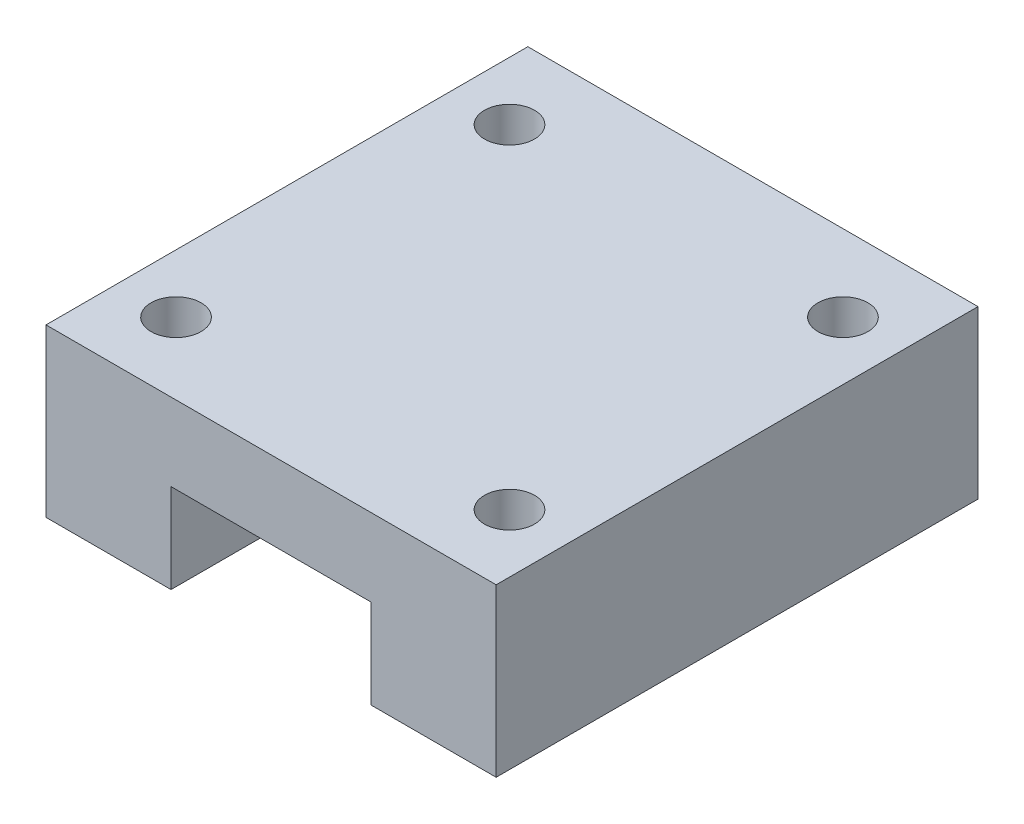
ISO-10303-21;
HEADER;
FILE_DESCRIPTION(('STEP AP214'),'2;1');
FILE_NAME('part.step','',(''),(''),'','','');
FILE_SCHEMA(('AUTOMOTIVE_DESIGN { 1 0 10303 214 1 1 1 1 }'));
ENDSEC;
DATA;
#1=APPLICATION_CONTEXT('core data for automotive mechanical design processes');
#2=APPLICATION_PROTOCOL_DEFINITION('international standard','automotive_design',2000,#1);
#3=PRODUCT_CONTEXT('',#1,'mechanical');
#4=PRODUCT('Part','Part','',(#3));
#5=PRODUCT_RELATED_PRODUCT_CATEGORY('part','',(#4));
#6=PRODUCT_DEFINITION_FORMATION('','',#4);
#7=PRODUCT_DEFINITION_CONTEXT('part definition',#1,'design');
#8=PRODUCT_DEFINITION('design','',#6,#7);
#9=PRODUCT_DEFINITION_SHAPE('','',#8);
#10=(LENGTH_UNIT() NAMED_UNIT(*) SI_UNIT(.MILLI.,.METRE.));
#11=(NAMED_UNIT(*) PLANE_ANGLE_UNIT() SI_UNIT($,.RADIAN.));
#12=(NAMED_UNIT(*) SI_UNIT($,.STERADIAN.) SOLID_ANGLE_UNIT());
#13=UNCERTAINTY_MEASURE_WITH_UNIT(LENGTH_MEASURE(1.E-05),#10,'distance_accuracy_value','');
#14=(GEOMETRIC_REPRESENTATION_CONTEXT(3) GLOBAL_UNCERTAINTY_ASSIGNED_CONTEXT((#13)) GLOBAL_UNIT_ASSIGNED_CONTEXT((#10,
#11,#12)) REPRESENTATION_CONTEXT('',''));
#15=CARTESIAN_POINT('',(0.,0.,0.));
#16=DIRECTION('',(0.,0.,1.));
#17=DIRECTION('',(1.,0.,0.));
#18=AXIS2_PLACEMENT_3D('',#15,#16,#17);
#19=CARTESIAN_POINT('',(0.,0.,0.));
#20=DIRECTION('',(0.,-1.,0.));
#21=DIRECTION('',(0.,0.,-1.));
#22=AXIS2_PLACEMENT_3D('',#19,#20,#21);
#23=PLANE('',#22);
#24=DIRECTION('',(0.,0.,1.));
#25=VECTOR('',#24,1.);
#26=CARTESIAN_POINT('',(7.5,0.,-28.9));
#27=LINE('',#26,#25);
#28=CARTESIAN_POINT('',(7.5,0.,-28.9));
#29=VERTEX_POINT('',#28);
#30=CARTESIAN_POINT('',(7.5,0.,0.));
#31=VERTEX_POINT('',#30);
#32=EDGE_CURVE('E161',#29,#31,#27,.T.);
#33=ORIENTED_EDGE('',*,*,#32,.T.);
#34=DIRECTION('',(1.,0.,0.));
#35=VECTOR('',#34,1.);
#36=CARTESIAN_POINT('',(0.,0.,0.));
#37=LINE('',#36,#35);
#38=CARTESIAN_POINT('',(0.,0.,0.));
#39=VERTEX_POINT('',#38);
#40=EDGE_CURVE('E193',#39,#31,#37,.T.);
#41=ORIENTED_EDGE('',*,*,#40,.F.);
#42=DIRECTION('',(0.,0.,1.));
#43=VECTOR('',#42,1.);
#44=CARTESIAN_POINT('',(0.,0.,0.));
#45=LINE('',#44,#43);
#46=CARTESIAN_POINT('',(0.,0.,-28.9));
#47=VERTEX_POINT('',#46);
#48=EDGE_CURVE('E181',#47,#39,#45,.T.);
#49=ORIENTED_EDGE('',*,*,#48,.F.);
#50=DIRECTION('',(-1.,0.,0.));
#51=VECTOR('',#50,1.);
#52=CARTESIAN_POINT('',(0.,0.,-28.9));
#53=LINE('',#52,#51);
#54=EDGE_CURVE('E83',#29,#47,#53,.T.);
#55=ORIENTED_EDGE('',*,*,#54,.F.);
#56=EDGE_LOOP('',(#33,#41,#49,#55));
#57=FACE_BOUND('',#56,.T.);
#58=ADVANCED_FACE('F38',(#57),#23,.T.);
#59=CARTESIAN_POINT('',(0.,10.,0.));
#60=DIRECTION('',(1.,0.,0.));
#61=DIRECTION('',(0.,0.,-1.));
#62=AXIS2_PLACEMENT_3D('',#59,#60,#61);
#63=PLANE('',#62);
#64=ORIENTED_EDGE('',*,*,#48,.T.);
#65=DIRECTION('',(0.,-1.,0.));
#66=VECTOR('',#65,1.);
#67=CARTESIAN_POINT('',(0.,10.,0.));
#68=LINE('',#67,#66);
#69=CARTESIAN_POINT('',(0.,10.,0.));
#70=VERTEX_POINT('',#69);
#71=EDGE_CURVE('E11',#70,#39,#68,.T.);
#72=ORIENTED_EDGE('',*,*,#71,.F.);
#73=DIRECTION('',(0.,0.,1.));
#74=VECTOR('',#73,1.);
#75=CARTESIAN_POINT('',(0.,10.,0.));
#76=LINE('',#75,#74);
#77=CARTESIAN_POINT('',(0.,10.,-28.9));
#78=VERTEX_POINT('',#77);
#79=EDGE_CURVE('E182',#78,#70,#76,.T.);
#80=ORIENTED_EDGE('',*,*,#79,.F.);
#81=DIRECTION('',(0.,-1.,0.));
#82=VECTOR('',#81,1.);
#83=CARTESIAN_POINT('',(0.,10.,-28.9));
#84=LINE('',#83,#82);
#85=EDGE_CURVE('E189',#78,#47,#84,.T.);
#86=ORIENTED_EDGE('',*,*,#85,.T.);
#87=EDGE_LOOP('',(#64,#72,#80,#86));
#88=FACE_BOUND('',#87,.T.);
#89=ADVANCED_FACE('F40',(#88),#63,.F.);
#90=CARTESIAN_POINT('',(0.,10.,0.));
#91=DIRECTION('',(0.,0.,-1.));
#92=DIRECTION('',(-1.,0.,0.));
#93=AXIS2_PLACEMENT_3D('',#90,#91,#92);
#94=PLANE('',#93);
#95=ORIENTED_EDGE('',*,*,#40,.T.);
#96=DIRECTION('',(0.,1.,0.));
#97=VECTOR('',#96,1.);
#98=CARTESIAN_POINT('',(7.5,10.,0.));
#99=LINE('',#98,#97);
#100=CARTESIAN_POINT('',(7.5,5.35,0.));
#101=VERTEX_POINT('',#100);
#102=EDGE_CURVE('E175',#31,#101,#99,.T.);
#103=ORIENTED_EDGE('',*,*,#102,.T.);
#104=DIRECTION('',(1.,0.,0.));
#105=VECTOR('',#104,1.);
#106=CARTESIAN_POINT('',(0.,5.35,0.));
#107=LINE('',#106,#105);
#108=CARTESIAN_POINT('',(19.5,5.35,0.));
#109=VERTEX_POINT('',#108);
#110=EDGE_CURVE('E178',#101,#109,#107,.T.);
#111=ORIENTED_EDGE('',*,*,#110,.T.);
#112=DIRECTION('',(0.,-1.,0.));
#113=VECTOR('',#112,1.);
#114=CARTESIAN_POINT('',(19.5,10.,0.));
#115=LINE('',#114,#113);
#116=CARTESIAN_POINT('',(19.5,0.,0.));
#117=VERTEX_POINT('',#116);
#118=EDGE_CURVE('E165',#109,#117,#115,.T.);
#119=ORIENTED_EDGE('',*,*,#118,.T.);
#120=CARTESIAN_POINT('',(27.,0.,0.));
#121=VERTEX_POINT('',#120);
#122=EDGE_CURVE('E192',#117,#121,#37,.T.);
#123=ORIENTED_EDGE('',*,*,#122,.T.);
#124=DIRECTION('',(0.,-1.,0.));
#125=VECTOR('',#124,1.);
#126=CARTESIAN_POINT('',(27.,10.,0.));
#127=LINE('',#126,#125);
#128=CARTESIAN_POINT('',(27.,10.,0.));
#129=VERTEX_POINT('',#128);
#130=EDGE_CURVE('E46',#129,#121,#127,.T.);
#131=ORIENTED_EDGE('',*,*,#130,.F.);
#132=DIRECTION('',(1.,0.,0.));
#133=VECTOR('',#132,1.);
#134=CARTESIAN_POINT('',(0.,10.,0.));
#135=LINE('',#134,#133);
#136=EDGE_CURVE('E90',#70,#129,#135,.T.);
#137=ORIENTED_EDGE('',*,*,#136,.F.);
#138=ORIENTED_EDGE('',*,*,#71,.T.);
#139=EDGE_LOOP('',(#95,#103,#111,#119,#123,#131,#137,#138));
#140=FACE_BOUND('',#139,.T.);
#141=ADVANCED_FACE('F237',(#140),#94,.F.);
#142=CARTESIAN_POINT('',(27.,10.,0.));
#143=DIRECTION('',(-1.,0.,0.));
#144=DIRECTION('',(0.,0.,1.));
#145=AXIS2_PLACEMENT_3D('',#142,#143,#144);
#146=PLANE('',#145);
#147=DIRECTION('',(0.,0.,-1.));
#148=VECTOR('',#147,1.);
#149=CARTESIAN_POINT('',(27.,0.,0.));
#150=LINE('',#149,#148);
#151=CARTESIAN_POINT('',(27.,0.,-28.9));
#152=VERTEX_POINT('',#151);
#153=EDGE_CURVE('E196',#121,#152,#150,.T.);
#154=ORIENTED_EDGE('',*,*,#153,.T.);
#155=DIRECTION('',(0.,-1.,0.));
#156=VECTOR('',#155,1.);
#157=CARTESIAN_POINT('',(27.,10.,-28.9));
#158=LINE('',#157,#156);
#159=CARTESIAN_POINT('',(27.,10.,-28.9));
#160=VERTEX_POINT('',#159);
#161=EDGE_CURVE('E201',#160,#152,#158,.T.);
#162=ORIENTED_EDGE('',*,*,#161,.F.);
#163=DIRECTION('',(0.,0.,-1.));
#164=VECTOR('',#163,1.);
#165=CARTESIAN_POINT('',(27.,10.,0.));
#166=LINE('',#165,#164);
#167=EDGE_CURVE('E186',#129,#160,#166,.T.);
#168=ORIENTED_EDGE('',*,*,#167,.F.);
#169=ORIENTED_EDGE('',*,*,#130,.T.);
#170=EDGE_LOOP('',(#154,#162,#168,#169));
#171=FACE_BOUND('',#170,.T.);
#172=ADVANCED_FACE('F207',(#171),#146,.F.);
#173=CARTESIAN_POINT('',(0.,10.,-28.9));
#174=DIRECTION('',(0.,0.,1.));
#175=DIRECTION('',(1.,0.,0.));
#176=AXIS2_PLACEMENT_3D('',#173,#174,#175);
#177=PLANE('',#176);
#178=DIRECTION('',(-1.,0.,0.));
#179=VECTOR('',#178,1.);
#180=CARTESIAN_POINT('',(7.5,5.35,-28.9));
#181=LINE('',#180,#179);
#182=CARTESIAN_POINT('',(19.5,5.35,-28.9));
#183=VERTEX_POINT('',#182);
#184=CARTESIAN_POINT('',(7.5,5.35,-28.9));
#185=VERTEX_POINT('',#184);
#186=EDGE_CURVE('E158',#183,#185,#181,.T.);
#187=ORIENTED_EDGE('',*,*,#186,.T.);
#188=DIRECTION('',(0.,-1.,0.));
#189=VECTOR('',#188,1.);
#190=CARTESIAN_POINT('',(7.5,0.,-28.9));
#191=LINE('',#190,#189);
#192=EDGE_CURVE('E155',#185,#29,#191,.T.);
#193=ORIENTED_EDGE('',*,*,#192,.T.);
#194=ORIENTED_EDGE('',*,*,#54,.T.);
#195=ORIENTED_EDGE('',*,*,#85,.F.);
#196=DIRECTION('',(-1.,0.,0.));
#197=VECTOR('',#196,1.);
#198=CARTESIAN_POINT('',(0.,10.,-28.9));
#199=LINE('',#198,#197);
#200=EDGE_CURVE('E62',#160,#78,#199,.T.);
#201=ORIENTED_EDGE('',*,*,#200,.F.);
#202=ORIENTED_EDGE('',*,*,#161,.T.);
#203=CARTESIAN_POINT('',(19.5,0.,-28.9));
#204=VERTEX_POINT('',#203);
#205=EDGE_CURVE('E184',#152,#204,#53,.T.);
#206=ORIENTED_EDGE('',*,*,#205,.T.);
#207=DIRECTION('',(0.,1.,0.));
#208=VECTOR('',#207,1.);
#209=CARTESIAN_POINT('',(19.5,0.,-28.9));
#210=LINE('',#209,#208);
#211=EDGE_CURVE('E53',#204,#183,#210,.T.);
#212=ORIENTED_EDGE('',*,*,#211,.T.);
#213=EDGE_LOOP('',(#187,#193,#194,#195,#201,#202,#206,#212));
#214=FACE_BOUND('',#213,.T.);
#215=ADVANCED_FACE('F213',(#214),#177,.F.);
#216=CARTESIAN_POINT('',(0.,10.,0.));
#217=DIRECTION('',(0.,-1.,0.));
#218=DIRECTION('',(0.,0.,-1.));
#219=AXIS2_PLACEMENT_3D('',#216,#217,#218);
#220=PLANE('',#219);
#221=CARTESIAN_POINT('',(3.5,10.,-24.3));
#222=DIRECTION('',(0.,1.,0.));
#223=DIRECTION('',(0.,0.,1.));
#224=AXIS2_PLACEMENT_3D('',#221,#222,#223);
#225=CIRCLE('',#224,1.49999999999999);
#226=CARTESIAN_POINT('',(3.5,10.,-22.8));
#227=VERTEX_POINT('',#226);
#228=EDGE_CURVE('E133',#227,#227,#225,.T.);
#229=ORIENTED_EDGE('',*,*,#228,.F.);
#230=EDGE_LOOP('',(#229));
#231=FACE_BOUND('',#230,.T.);
#232=CARTESIAN_POINT('',(23.5,10.,-24.3));
#233=DIRECTION('',(0.,1.,0.));
#234=DIRECTION('',(0.,0.,1.));
#235=AXIS2_PLACEMENT_3D('',#232,#233,#234);
#236=CIRCLE('',#235,1.49999999999999);
#237=CARTESIAN_POINT('',(23.5,10.,-22.8));
#238=VERTEX_POINT('',#237);
#239=EDGE_CURVE('E132',#238,#238,#236,.T.);
#240=ORIENTED_EDGE('',*,*,#239,.F.);
#241=EDGE_LOOP('',(#240));
#242=FACE_BOUND('',#241,.T.);
#243=CARTESIAN_POINT('',(3.5,10.,-4.3));
#244=DIRECTION('',(0.,1.,0.));
#245=DIRECTION('',(0.,0.,1.));
#246=AXIS2_PLACEMENT_3D('',#243,#244,#245);
#247=CIRCLE('',#246,1.49999999999999);
#248=CARTESIAN_POINT('',(3.5,10.,-2.80000000000001));
#249=VERTEX_POINT('',#248);
#250=EDGE_CURVE('E143',#249,#249,#247,.T.);
#251=ORIENTED_EDGE('',*,*,#250,.F.);
#252=EDGE_LOOP('',(#251));
#253=FACE_BOUND('',#252,.T.);
#254=CARTESIAN_POINT('',(23.5,10.,-4.3));
#255=DIRECTION('',(0.,1.,0.));
#256=DIRECTION('',(0.,0.,1.));
#257=AXIS2_PLACEMENT_3D('',#254,#255,#256);
#258=CIRCLE('',#257,1.49999999999999);
#259=CARTESIAN_POINT('',(23.5,10.,-2.80000000000001));
#260=VERTEX_POINT('',#259);
#261=EDGE_CURVE('E149',#260,#260,#258,.T.);
#262=ORIENTED_EDGE('',*,*,#261,.F.);
#263=EDGE_LOOP('',(#262));
#264=FACE_BOUND('',#263,.T.);
#265=ORIENTED_EDGE('',*,*,#79,.T.);
#266=ORIENTED_EDGE('',*,*,#136,.T.);
#267=ORIENTED_EDGE('',*,*,#167,.T.);
#268=ORIENTED_EDGE('',*,*,#200,.T.);
#269=EDGE_LOOP('',(#265,#266,#267,#268));
#270=FACE_BOUND('',#269,.T.);
#271=ADVANCED_FACE('F218',(#231,#242,#253,#264,#270),#220,.F.);
#272=DIRECTION('',(0.,0.,1.));
#273=VECTOR('',#272,1.);
#274=CARTESIAN_POINT('',(19.5,0.,-28.9));
#275=LINE('',#274,#273);
#276=EDGE_CURVE('E169',#204,#117,#275,.T.);
#277=ORIENTED_EDGE('',*,*,#276,.F.);
#278=ORIENTED_EDGE('',*,*,#205,.F.);
#279=ORIENTED_EDGE('',*,*,#153,.F.);
#280=ORIENTED_EDGE('',*,*,#122,.F.);
#281=EDGE_LOOP('',(#277,#278,#279,#280));
#282=FACE_BOUND('',#281,.T.);
#283=ADVANCED_FACE('F212',(#282),#23,.T.);
#284=CARTESIAN_POINT('',(7.5,5.35,-28.9));
#285=DIRECTION('',(0.,1.,0.));
#286=DIRECTION('',(0.,0.,1.));
#287=AXIS2_PLACEMENT_3D('',#284,#285,#286);
#288=PLANE('',#287);
#289=DIRECTION('',(0.,0.,1.));
#290=VECTOR('',#289,1.);
#291=CARTESIAN_POINT('',(7.5,5.35,-28.9));
#292=LINE('',#291,#290);
#293=EDGE_CURVE('E162',#185,#101,#292,.T.);
#294=ORIENTED_EDGE('',*,*,#293,.F.);
#295=ORIENTED_EDGE('',*,*,#186,.F.);
#296=DIRECTION('',(0.,0.,1.));
#297=VECTOR('',#296,1.);
#298=CARTESIAN_POINT('',(19.5,5.35,-28.9));
#299=LINE('',#298,#297);
#300=EDGE_CURVE('E166',#183,#109,#299,.T.);
#301=ORIENTED_EDGE('',*,*,#300,.T.);
#302=ORIENTED_EDGE('',*,*,#110,.F.);
#303=EDGE_LOOP('',(#294,#295,#301,#302));
#304=FACE_BOUND('',#303,.T.);
#305=ADVANCED_FACE('F226',(#304),#288,.F.);
#306=CARTESIAN_POINT('',(7.5,0.,-28.9));
#307=DIRECTION('',(-1.,0.,0.));
#308=DIRECTION('',(0.,0.,1.));
#309=AXIS2_PLACEMENT_3D('',#306,#307,#308);
#310=PLANE('',#309);
#311=ORIENTED_EDGE('',*,*,#32,.F.);
#312=ORIENTED_EDGE('',*,*,#192,.F.);
#313=ORIENTED_EDGE('',*,*,#293,.T.);
#314=ORIENTED_EDGE('',*,*,#102,.F.);
#315=EDGE_LOOP('',(#311,#312,#313,#314));
#316=FACE_BOUND('',#315,.T.);
#317=ADVANCED_FACE('F245',(#316),#310,.F.);
#318=CARTESIAN_POINT('',(19.5,0.,-28.9));
#319=DIRECTION('',(1.,0.,0.));
#320=DIRECTION('',(0.,0.,-1.));
#321=AXIS2_PLACEMENT_3D('',#318,#319,#320);
#322=PLANE('',#321);
#323=ORIENTED_EDGE('',*,*,#300,.F.);
#324=ORIENTED_EDGE('',*,*,#211,.F.);
#325=ORIENTED_EDGE('',*,*,#276,.T.);
#326=ORIENTED_EDGE('',*,*,#118,.F.);
#327=EDGE_LOOP('',(#323,#324,#325,#326));
#328=FACE_BOUND('',#327,.T.);
#329=ADVANCED_FACE('F248',(#328),#322,.F.);
#330=CARTESIAN_POINT('',(23.5,7.,-4.3));
#331=DIRECTION('',(0.,1.,0.));
#332=DIRECTION('',(0.,0.,1.));
#333=AXIS2_PLACEMENT_3D('',#330,#331,#332);
#334=CONICAL_SURFACE('',#333,1.5,1.02974425867665);
#335=CARTESIAN_POINT('',(23.5,6.09870907145866,-4.3));
#336=VERTEX_POINT('',#335);
#337=VERTEX_LOOP('',#336);
#338=FACE_BOUND('',#337,.T.);
#339=CARTESIAN_POINT('',(23.5,7.,-4.3));
#340=DIRECTION('',(0.,1.,0.));
#341=DIRECTION('',(0.,0.,1.));
#342=AXIS2_PLACEMENT_3D('',#339,#340,#341);
#343=CIRCLE('',#342,1.5);
#344=CARTESIAN_POINT('',(23.5,7.,-2.8));
#345=VERTEX_POINT('',#344);
#346=EDGE_CURVE('E152',#345,#345,#343,.T.);
#347=ORIENTED_EDGE('',*,*,#346,.T.);
#348=EDGE_LOOP('',(#347));
#349=FACE_BOUND('',#348,.T.);
#350=ADVANCED_FACE('F250',(#338,#349),#334,.F.);
#351=CARTESIAN_POINT('',(23.5,10.,-4.3));
#352=DIRECTION('',(0.,1.,0.));
#353=DIRECTION('',(0.,0.,1.));
#354=AXIS2_PLACEMENT_3D('',#351,#352,#353);
#355=CYLINDRICAL_SURFACE('',#354,1.49999999999999);
#356=ORIENTED_EDGE('',*,*,#346,.F.);
#357=EDGE_LOOP('',(#356));
#358=FACE_BOUND('',#357,.T.);
#359=ORIENTED_EDGE('',*,*,#261,.T.);
#360=EDGE_LOOP('',(#359));
#361=FACE_BOUND('',#360,.T.);
#362=ADVANCED_FACE('F256',(#358,#361),#355,.F.);
#363=CARTESIAN_POINT('',(3.5,7.,-4.3));
#364=DIRECTION('',(0.,1.,0.));
#365=DIRECTION('',(0.,0.,1.));
#366=AXIS2_PLACEMENT_3D('',#363,#364,#365);
#367=CONICAL_SURFACE('',#366,1.5,1.02974425867665);
#368=CARTESIAN_POINT('',(3.5,6.09870907145866,-4.3));
#369=VERTEX_POINT('',#368);
#370=VERTEX_LOOP('',#369);
#371=FACE_BOUND('',#370,.T.);
#372=CARTESIAN_POINT('',(3.5,7.,-4.3));
#373=DIRECTION('',(0.,1.,0.));
#374=DIRECTION('',(0.,0.,1.));
#375=AXIS2_PLACEMENT_3D('',#372,#373,#374);
#376=CIRCLE('',#375,1.5);
#377=CARTESIAN_POINT('',(3.5,7.,-2.8));
#378=VERTEX_POINT('',#377);
#379=EDGE_CURVE('E146',#378,#378,#376,.T.);
#380=ORIENTED_EDGE('',*,*,#379,.T.);
#381=EDGE_LOOP('',(#380));
#382=FACE_BOUND('',#381,.T.);
#383=ADVANCED_FACE('F264',(#371,#382),#367,.F.);
#384=CARTESIAN_POINT('',(3.5,10.,-4.3));
#385=DIRECTION('',(0.,1.,0.));
#386=DIRECTION('',(0.,0.,1.));
#387=AXIS2_PLACEMENT_3D('',#384,#385,#386);
#388=CYLINDRICAL_SURFACE('',#387,1.49999999999999);
#389=ORIENTED_EDGE('',*,*,#379,.F.);
#390=EDGE_LOOP('',(#389));
#391=FACE_BOUND('',#390,.T.);
#392=ORIENTED_EDGE('',*,*,#250,.T.);
#393=EDGE_LOOP('',(#392));
#394=FACE_BOUND('',#393,.T.);
#395=ADVANCED_FACE('F268',(#391,#394),#388,.F.);
#396=CARTESIAN_POINT('',(23.5,7.,-24.3));
#397=DIRECTION('',(0.,1.,0.));
#398=DIRECTION('',(0.,0.,1.));
#399=AXIS2_PLACEMENT_3D('',#396,#397,#398);
#400=CONICAL_SURFACE('',#399,1.5,1.02974425867665);
#401=CARTESIAN_POINT('',(23.5,6.09870907145866,-24.3));
#402=VERTEX_POINT('',#401);
#403=VERTEX_LOOP('',#402);
#404=FACE_BOUND('',#403,.T.);
#405=CARTESIAN_POINT('',(23.5,7.,-24.3));
#406=DIRECTION('',(0.,1.,0.));
#407=DIRECTION('',(0.,0.,1.));
#408=AXIS2_PLACEMENT_3D('',#405,#406,#407);
#409=CIRCLE('',#408,1.5);
#410=CARTESIAN_POINT('',(23.5,7.,-22.8));
#411=VERTEX_POINT('',#410);
#412=EDGE_CURVE('E136',#411,#411,#409,.T.);
#413=ORIENTED_EDGE('',*,*,#412,.T.);
#414=EDGE_LOOP('',(#413));
#415=FACE_BOUND('',#414,.T.);
#416=ADVANCED_FACE('F272',(#404,#415),#400,.F.);
#417=CARTESIAN_POINT('',(23.5,10.,-24.3));
#418=DIRECTION('',(0.,1.,0.));
#419=DIRECTION('',(0.,0.,1.));
#420=AXIS2_PLACEMENT_3D('',#417,#418,#419);
#421=CYLINDRICAL_SURFACE('',#420,1.49999999999999);
#422=ORIENTED_EDGE('',*,*,#412,.F.);
#423=EDGE_LOOP('',(#422));
#424=FACE_BOUND('',#423,.T.);
#425=ORIENTED_EDGE('',*,*,#239,.T.);
#426=EDGE_LOOP('',(#425));
#427=FACE_BOUND('',#426,.T.);
#428=ADVANCED_FACE('F126',(#424,#427),#421,.F.);
#429=CARTESIAN_POINT('',(3.5,7.,-24.3));
#430=DIRECTION('',(0.,1.,0.));
#431=DIRECTION('',(0.,0.,1.));
#432=AXIS2_PLACEMENT_3D('',#429,#430,#431);
#433=CONICAL_SURFACE('',#432,1.5,1.02974425867665);
#434=CARTESIAN_POINT('',(3.5,6.09870907145866,-24.3));
#435=VERTEX_POINT('',#434);
#436=VERTEX_LOOP('',#435);
#437=FACE_BOUND('',#436,.T.);
#438=CARTESIAN_POINT('',(3.5,7.,-24.3));
#439=DIRECTION('',(0.,1.,0.));
#440=DIRECTION('',(0.,0.,1.));
#441=AXIS2_PLACEMENT_3D('',#438,#439,#440);
#442=CIRCLE('',#441,1.5);
#443=CARTESIAN_POINT('',(3.5,7.,-22.8));
#444=VERTEX_POINT('',#443);
#445=EDGE_CURVE('E130',#444,#444,#442,.T.);
#446=ORIENTED_EDGE('',*,*,#445,.T.);
#447=EDGE_LOOP('',(#446));
#448=FACE_BOUND('',#447,.T.);
#449=ADVANCED_FACE('F122',(#437,#448),#433,.F.);
#450=CARTESIAN_POINT('',(3.5,10.,-24.3));
#451=DIRECTION('',(0.,1.,0.));
#452=DIRECTION('',(0.,0.,1.));
#453=AXIS2_PLACEMENT_3D('',#450,#451,#452);
#454=CYLINDRICAL_SURFACE('',#453,1.49999999999999);
#455=ORIENTED_EDGE('',*,*,#445,.F.);
#456=EDGE_LOOP('',(#455));
#457=FACE_BOUND('',#456,.T.);
#458=ORIENTED_EDGE('',*,*,#228,.T.);
#459=EDGE_LOOP('',(#458));
#460=FACE_BOUND('',#459,.T.);
#461=ADVANCED_FACE('F125',(#457,#460),#454,.F.);
#462=CLOSED_SHELL('',(#58,#89,#141,#172,#215,#271,#283,#305,#317,#329,#350,#362,#383,#395,#416,
#428,#449,#461));
#463=MANIFOLD_SOLID_BREP('B2',#462);
#464=ADVANCED_BREP_SHAPE_REPRESENTATION('',(#18,#463),#14);
#465=SHAPE_DEFINITION_REPRESENTATION(#9,#464);
ENDSEC;
END-ISO-10303-21;
